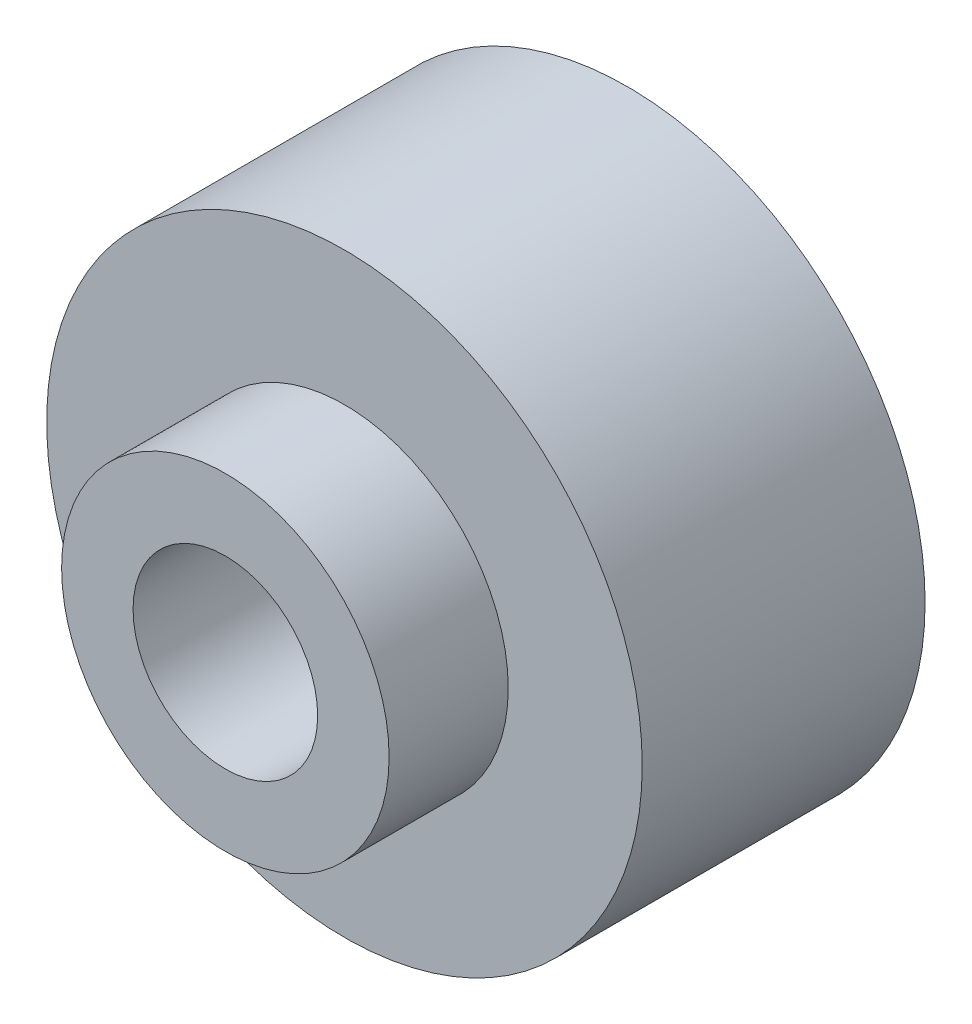
ISO-10303-21;
HEADER;
FILE_DESCRIPTION(('STEP AP214'),'2;1');
FILE_NAME('part.step','',(''),(''),'','','');
FILE_SCHEMA(('AUTOMOTIVE_DESIGN { 1 0 10303 214 1 1 1 1 }'));
ENDSEC;
DATA;
#1=APPLICATION_CONTEXT('core data for automotive mechanical design processes');
#2=APPLICATION_PROTOCOL_DEFINITION('international standard','automotive_design',2000,#1);
#3=PRODUCT_CONTEXT('',#1,'mechanical');
#4=PRODUCT('Part','Part','',(#3));
#5=PRODUCT_RELATED_PRODUCT_CATEGORY('part','',(#4));
#6=PRODUCT_DEFINITION_FORMATION('','',#4);
#7=PRODUCT_DEFINITION_CONTEXT('part definition',#1,'design');
#8=PRODUCT_DEFINITION('design','',#6,#7);
#9=PRODUCT_DEFINITION_SHAPE('','',#8);
#10=(LENGTH_UNIT() NAMED_UNIT(*) SI_UNIT(.MILLI.,.METRE.));
#11=(NAMED_UNIT(*) PLANE_ANGLE_UNIT() SI_UNIT($,.RADIAN.));
#12=(NAMED_UNIT(*) SI_UNIT($,.STERADIAN.) SOLID_ANGLE_UNIT());
#13=UNCERTAINTY_MEASURE_WITH_UNIT(LENGTH_MEASURE(1.E-05),#10,'distance_accuracy_value','');
#14=(GEOMETRIC_REPRESENTATION_CONTEXT(3) GLOBAL_UNCERTAINTY_ASSIGNED_CONTEXT((#13)) GLOBAL_UNIT_ASSIGNED_CONTEXT((#10,
#11,#12)) REPRESENTATION_CONTEXT('',''));
#15=CARTESIAN_POINT('',(0.,0.,0.));
#16=DIRECTION('',(0.,0.,1.));
#17=DIRECTION('',(1.,0.,0.));
#18=AXIS2_PLACEMENT_3D('',#15,#16,#17);
#19=CARTESIAN_POINT('',(0.,0.,4.75));
#20=DIRECTION('',(0.,0.,-1.));
#21=DIRECTION('',(-1.,0.,0.));
#22=AXIS2_PLACEMENT_3D('',#19,#20,#21);
#23=CYLINDRICAL_SURFACE('',#22,1.55);
#24=CARTESIAN_POINT('',(0.,0.,6.75));
#25=DIRECTION('',(0.,0.,1.));
#26=DIRECTION('',(1.,0.,0.));
#27=AXIS2_PLACEMENT_3D('',#24,#25,#26);
#28=CIRCLE('',#27,1.55);
#29=CARTESIAN_POINT('',(1.55,0.,6.75));
#30=VERTEX_POINT('',#29);
#31=EDGE_CURVE('E49',#30,#30,#28,.T.);
#32=ORIENTED_EDGE('',*,*,#31,.T.);
#33=EDGE_LOOP('',(#32));
#34=FACE_BOUND('',#33,.T.);
#35=CARTESIAN_POINT('',(0.,0.,2.));
#36=DIRECTION('',(0.,0.,-1.));
#37=DIRECTION('',(-1.,0.,0.));
#38=AXIS2_PLACEMENT_3D('',#35,#36,#37);
#39=CIRCLE('',#38,1.55);
#40=CARTESIAN_POINT('',(-1.55,0.,2.));
#41=VERTEX_POINT('',#40);
#42=EDGE_CURVE('E58',#41,#41,#39,.T.);
#43=ORIENTED_EDGE('',*,*,#42,.T.);
#44=EDGE_LOOP('',(#43));
#45=FACE_BOUND('',#44,.T.);
#46=ADVANCED_FACE('F33',(#34,#45),#23,.F.);
#47=CARTESIAN_POINT('',(0.,0.,4.75));
#48=DIRECTION('',(0.,0.,1.));
#49=DIRECTION('',(1.,0.,0.));
#50=AXIS2_PLACEMENT_3D('',#47,#48,#49);
#51=PLANE('',#50);
#52=CARTESIAN_POINT('',(0.,0.,4.75));
#53=DIRECTION('',(0.,0.,1.));
#54=DIRECTION('',(1.,0.,0.));
#55=AXIS2_PLACEMENT_3D('',#52,#53,#54);
#56=CIRCLE('',#55,5.);
#57=CARTESIAN_POINT('',(5.,0.,4.75));
#58=VERTEX_POINT('',#57);
#59=EDGE_CURVE('E10',#58,#58,#56,.T.);
#60=ORIENTED_EDGE('',*,*,#59,.T.);
#61=EDGE_LOOP('',(#60));
#62=FACE_BOUND('',#61,.T.);
#63=CARTESIAN_POINT('',(0.,0.,4.75));
#64=DIRECTION('',(0.,0.,1.));
#65=DIRECTION('',(1.,0.,0.));
#66=AXIS2_PLACEMENT_3D('',#63,#64,#65);
#67=CIRCLE('',#66,2.75);
#68=CARTESIAN_POINT('',(2.75,0.,4.75));
#69=VERTEX_POINT('',#68);
#70=EDGE_CURVE('E46',#69,#69,#67,.T.);
#71=ORIENTED_EDGE('',*,*,#70,.F.);
#72=EDGE_LOOP('',(#71));
#73=FACE_BOUND('',#72,.T.);
#74=ADVANCED_FACE('F81',(#62,#73),#51,.T.);
#75=CARTESIAN_POINT('',(0.,0.,0.));
#76=DIRECTION('',(0.,0.,1.));
#77=DIRECTION('',(1.,0.,0.));
#78=AXIS2_PLACEMENT_3D('',#75,#76,#77);
#79=PLANE('',#78);
#80=CARTESIAN_POINT('',(0.,0.,0.));
#81=DIRECTION('',(0.,0.,-1.));
#82=DIRECTION('',(-1.,0.,0.));
#83=AXIS2_PLACEMENT_3D('',#80,#81,#82);
#84=CIRCLE('',#83,3.5);
#85=CARTESIAN_POINT('',(-3.5,0.,0.));
#86=VERTEX_POINT('',#85);
#87=EDGE_CURVE('E55',#86,#86,#84,.T.);
#88=ORIENTED_EDGE('',*,*,#87,.F.);
#89=EDGE_LOOP('',(#88));
#90=FACE_BOUND('',#89,.T.);
#91=CARTESIAN_POINT('',(0.,0.,0.));
#92=DIRECTION('',(0.,0.,1.));
#93=DIRECTION('',(1.,0.,0.));
#94=AXIS2_PLACEMENT_3D('',#91,#92,#93);
#95=CIRCLE('',#94,5.);
#96=CARTESIAN_POINT('',(5.,0.,0.));
#97=VERTEX_POINT('',#96);
#98=EDGE_CURVE('E37',#97,#97,#95,.T.);
#99=ORIENTED_EDGE('',*,*,#98,.F.);
#100=EDGE_LOOP('',(#99));
#101=FACE_BOUND('',#100,.T.);
#102=ADVANCED_FACE('F78',(#90,#101),#79,.F.);
#103=CARTESIAN_POINT('',(0.,0.,4.75));
#104=DIRECTION('',(0.,0.,-1.));
#105=DIRECTION('',(-1.,0.,0.));
#106=AXIS2_PLACEMENT_3D('',#103,#104,#105);
#107=CYLINDRICAL_SURFACE('',#106,5.);
#108=ORIENTED_EDGE('',*,*,#59,.F.);
#109=EDGE_LOOP('',(#108));
#110=FACE_BOUND('',#109,.T.);
#111=ORIENTED_EDGE('',*,*,#98,.T.);
#112=EDGE_LOOP('',(#111));
#113=FACE_BOUND('',#112,.T.);
#114=ADVANCED_FACE('F35',(#110,#113),#107,.T.);
#115=CARTESIAN_POINT('',(0.,0.,6.75));
#116=DIRECTION('',(0.,0.,1.));
#117=DIRECTION('',(1.,0.,0.));
#118=AXIS2_PLACEMENT_3D('',#115,#116,#117);
#119=PLANE('',#118);
#120=CARTESIAN_POINT('',(0.,0.,6.75));
#121=DIRECTION('',(0.,0.,1.));
#122=DIRECTION('',(1.,0.,0.));
#123=AXIS2_PLACEMENT_3D('',#120,#121,#122);
#124=CIRCLE('',#123,2.75);
#125=CARTESIAN_POINT('',(2.75,0.,6.75));
#126=VERTEX_POINT('',#125);
#127=EDGE_CURVE('E44',#126,#126,#124,.T.);
#128=ORIENTED_EDGE('',*,*,#127,.T.);
#129=EDGE_LOOP('',(#128));
#130=FACE_BOUND('',#129,.T.);
#131=ORIENTED_EDGE('',*,*,#31,.F.);
#132=EDGE_LOOP('',(#131));
#133=FACE_BOUND('',#132,.T.);
#134=ADVANCED_FACE('F85',(#130,#133),#119,.T.);
#135=CARTESIAN_POINT('',(0.,0.,6.75));
#136=DIRECTION('',(0.,0.,-1.));
#137=DIRECTION('',(-1.,0.,0.));
#138=AXIS2_PLACEMENT_3D('',#135,#136,#137);
#139=CYLINDRICAL_SURFACE('',#138,2.75);
#140=ORIENTED_EDGE('',*,*,#127,.F.);
#141=EDGE_LOOP('',(#140));
#142=FACE_BOUND('',#141,.T.);
#143=ORIENTED_EDGE('',*,*,#70,.T.);
#144=EDGE_LOOP('',(#143));
#145=FACE_BOUND('',#144,.T.);
#146=ADVANCED_FACE('F74',(#142,#145),#139,.T.);
#147=CARTESIAN_POINT('',(0.,0.,2.));
#148=DIRECTION('',(0.,0.,-1.));
#149=DIRECTION('',(-1.,0.,0.));
#150=AXIS2_PLACEMENT_3D('',#147,#148,#149);
#151=CYLINDRICAL_SURFACE('',#150,3.5);
#152=CARTESIAN_POINT('',(0.,0.,2.));
#153=DIRECTION('',(0.,0.,-1.));
#154=DIRECTION('',(-1.,0.,0.));
#155=AXIS2_PLACEMENT_3D('',#152,#153,#154);
#156=CIRCLE('',#155,3.5);
#157=CARTESIAN_POINT('',(-3.5,0.,2.));
#158=VERTEX_POINT('',#157);
#159=EDGE_CURVE('E54',#158,#158,#156,.T.);
#160=ORIENTED_EDGE('',*,*,#159,.F.);
#161=EDGE_LOOP('',(#160));
#162=FACE_BOUND('',#161,.T.);
#163=ORIENTED_EDGE('',*,*,#87,.T.);
#164=EDGE_LOOP('',(#163));
#165=FACE_BOUND('',#164,.T.);
#166=ADVANCED_FACE('F68',(#162,#165),#151,.F.);
#167=CARTESIAN_POINT('',(0.,0.,2.));
#168=DIRECTION('',(0.,0.,-1.));
#169=DIRECTION('',(-1.,0.,0.));
#170=AXIS2_PLACEMENT_3D('',#167,#168,#169);
#171=PLANE('',#170);
#172=ORIENTED_EDGE('',*,*,#42,.F.);
#173=EDGE_LOOP('',(#172));
#174=FACE_BOUND('',#173,.T.);
#175=ORIENTED_EDGE('',*,*,#159,.T.);
#176=EDGE_LOOP('',(#175));
#177=FACE_BOUND('',#176,.T.);
#178=ADVANCED_FACE('F65',(#174,#177),#171,.T.);
#179=CLOSED_SHELL('',(#46,#74,#102,#114,#134,#146,#166,#178));
#180=MANIFOLD_SOLID_BREP('B2',#179);
#181=ADVANCED_BREP_SHAPE_REPRESENTATION('',(#18,#180),#14);
#182=SHAPE_DEFINITION_REPRESENTATION(#9,#181);
ENDSEC;
END-ISO-10303-21;
